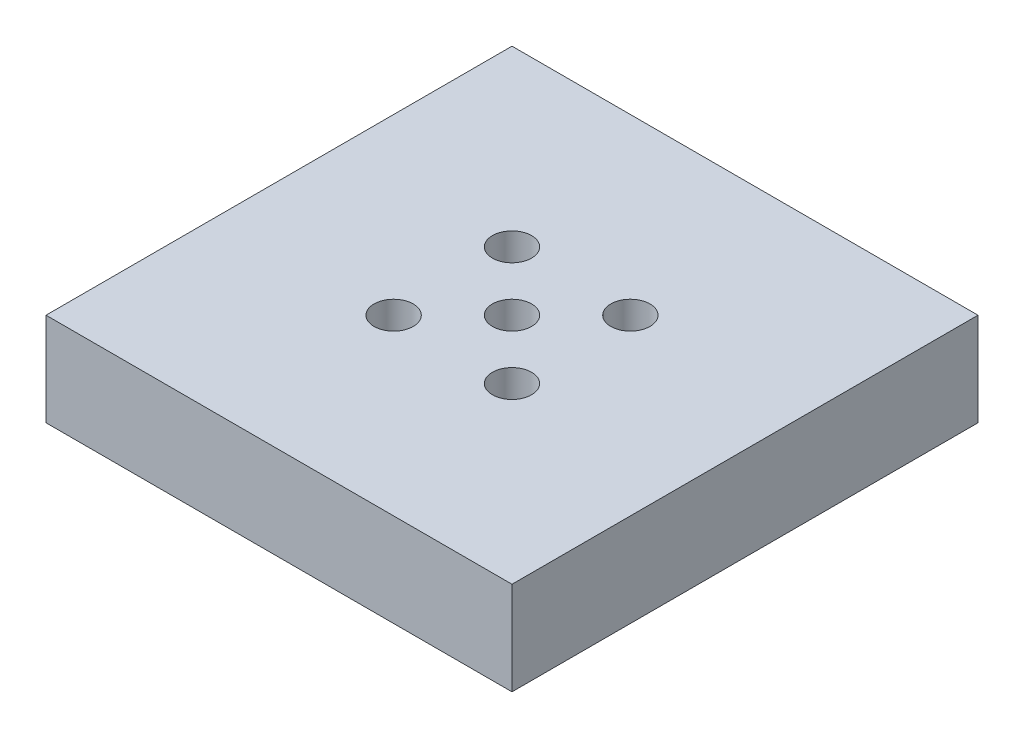
ISO-10303-21;
HEADER;
FILE_DESCRIPTION(('STEP AP214'),'2;1');
FILE_NAME('part.step','',(''),(''),'','','');
FILE_SCHEMA(('AUTOMOTIVE_DESIGN { 1 0 10303 214 1 1 1 1 }'));
ENDSEC;
DATA;
#1=APPLICATION_CONTEXT('core data for automotive mechanical design processes');
#2=APPLICATION_PROTOCOL_DEFINITION('international standard','automotive_design',2000,#1);
#3=PRODUCT_CONTEXT('',#1,'mechanical');
#4=PRODUCT('Part','Part','',(#3));
#5=PRODUCT_RELATED_PRODUCT_CATEGORY('part','',(#4));
#6=PRODUCT_DEFINITION_FORMATION('','',#4);
#7=PRODUCT_DEFINITION_CONTEXT('part definition',#1,'design');
#8=PRODUCT_DEFINITION('design','',#6,#7);
#9=PRODUCT_DEFINITION_SHAPE('','',#8);
#10=(LENGTH_UNIT() NAMED_UNIT(*) SI_UNIT(.MILLI.,.METRE.));
#11=(NAMED_UNIT(*) PLANE_ANGLE_UNIT() SI_UNIT($,.RADIAN.));
#12=(NAMED_UNIT(*) SI_UNIT($,.STERADIAN.) SOLID_ANGLE_UNIT());
#13=UNCERTAINTY_MEASURE_WITH_UNIT(LENGTH_MEASURE(1.E-05),#10,'distance_accuracy_value','');
#14=(GEOMETRIC_REPRESENTATION_CONTEXT(3) GLOBAL_UNCERTAINTY_ASSIGNED_CONTEXT((#13)) GLOBAL_UNIT_ASSIGNED_CONTEXT((#10,
#11,#12)) REPRESENTATION_CONTEXT('',''));
#15=CARTESIAN_POINT('',(0.,0.,0.));
#16=DIRECTION('',(0.,0.,1.));
#17=DIRECTION('',(1.,0.,0.));
#18=AXIS2_PLACEMENT_3D('',#15,#16,#17);
#19=CARTESIAN_POINT('',(25.,10.,-25.));
#20=DIRECTION('',(-1.,0.,0.));
#21=DIRECTION('',(0.,0.,1.));
#22=AXIS2_PLACEMENT_3D('',#19,#20,#21);
#23=PLANE('',#22);
#24=DIRECTION('',(0.,0.,-1.));
#25=VECTOR('',#24,1.);
#26=CARTESIAN_POINT('',(25.,0.,-25.));
#27=LINE('',#26,#25);
#28=CARTESIAN_POINT('',(25.,0.,25.));
#29=VERTEX_POINT('',#28);
#30=CARTESIAN_POINT('',(25.,0.,-25.));
#31=VERTEX_POINT('',#30);
#32=EDGE_CURVE('E206',#29,#31,#27,.T.);
#33=ORIENTED_EDGE('',*,*,#32,.T.);
#34=DIRECTION('',(0.,-1.,0.));
#35=VECTOR('',#34,1.);
#36=CARTESIAN_POINT('',(25.,10.,-25.));
#37=LINE('',#36,#35);
#38=CARTESIAN_POINT('',(25.,10.,-25.));
#39=VERTEX_POINT('',#38);
#40=EDGE_CURVE('E11',#39,#31,#37,.T.);
#41=ORIENTED_EDGE('',*,*,#40,.F.);
#42=DIRECTION('',(0.,0.,-1.));
#43=VECTOR('',#42,1.);
#44=CARTESIAN_POINT('',(25.,10.,-25.));
#45=LINE('',#44,#43);
#46=CARTESIAN_POINT('',(25.,10.,25.));
#47=VERTEX_POINT('',#46);
#48=EDGE_CURVE('E207',#47,#39,#45,.T.);
#49=ORIENTED_EDGE('',*,*,#48,.F.);
#50=DIRECTION('',(0.,-1.,0.));
#51=VECTOR('',#50,1.);
#52=CARTESIAN_POINT('',(25.,10.,25.));
#53=LINE('',#52,#51);
#54=EDGE_CURVE('E217',#47,#29,#53,.T.);
#55=ORIENTED_EDGE('',*,*,#54,.T.);
#56=EDGE_LOOP('',(#33,#41,#49,#55));
#57=FACE_BOUND('',#56,.T.);
#58=ADVANCED_FACE('F45',(#57),#23,.F.);
#59=CARTESIAN_POINT('',(-25.,10.,-25.));
#60=DIRECTION('',(0.,0.,1.));
#61=DIRECTION('',(1.,0.,0.));
#62=AXIS2_PLACEMENT_3D('',#59,#60,#61);
#63=PLANE('',#62);
#64=DIRECTION('',(-1.,0.,0.));
#65=VECTOR('',#64,1.);
#66=CARTESIAN_POINT('',(-25.,0.,-25.));
#67=LINE('',#66,#65);
#68=CARTESIAN_POINT('',(-25.,0.,-25.));
#69=VERTEX_POINT('',#68);
#70=EDGE_CURVE('E221',#31,#69,#67,.T.);
#71=ORIENTED_EDGE('',*,*,#70,.T.);
#72=DIRECTION('',(0.,-1.,0.));
#73=VECTOR('',#72,1.);
#74=CARTESIAN_POINT('',(-25.,10.,-25.));
#75=LINE('',#74,#73);
#76=CARTESIAN_POINT('',(-25.,10.,-25.));
#77=VERTEX_POINT('',#76);
#78=EDGE_CURVE('E53',#77,#69,#75,.T.);
#79=ORIENTED_EDGE('',*,*,#78,.F.);
#80=DIRECTION('',(-1.,0.,0.));
#81=VECTOR('',#80,1.);
#82=CARTESIAN_POINT('',(-25.,10.,-25.));
#83=LINE('',#82,#81);
#84=EDGE_CURVE('E97',#39,#77,#83,.T.);
#85=ORIENTED_EDGE('',*,*,#84,.F.);
#86=ORIENTED_EDGE('',*,*,#40,.T.);
#87=EDGE_LOOP('',(#71,#79,#85,#86));
#88=FACE_BOUND('',#87,.T.);
#89=ADVANCED_FACE('F256',(#88),#63,.F.);
#90=CARTESIAN_POINT('',(-25.,10.,-25.));
#91=DIRECTION('',(1.,0.,0.));
#92=DIRECTION('',(0.,0.,-1.));
#93=AXIS2_PLACEMENT_3D('',#90,#91,#92);
#94=PLANE('',#93);
#95=DIRECTION('',(0.,0.,1.));
#96=VECTOR('',#95,1.);
#97=CARTESIAN_POINT('',(-25.,0.,-25.));
#98=LINE('',#97,#96);
#99=CARTESIAN_POINT('',(-25.,0.,25.));
#100=VERTEX_POINT('',#99);
#101=EDGE_CURVE('E224',#69,#100,#98,.T.);
#102=ORIENTED_EDGE('',*,*,#101,.T.);
#103=DIRECTION('',(0.,-1.,0.));
#104=VECTOR('',#103,1.);
#105=CARTESIAN_POINT('',(-25.,10.,25.));
#106=LINE('',#105,#104);
#107=CARTESIAN_POINT('',(-25.,10.,25.));
#108=VERTEX_POINT('',#107);
#109=EDGE_CURVE('E231',#108,#100,#106,.T.);
#110=ORIENTED_EDGE('',*,*,#109,.F.);
#111=DIRECTION('',(0.,0.,1.));
#112=VECTOR('',#111,1.);
#113=CARTESIAN_POINT('',(-25.,10.,-25.));
#114=LINE('',#113,#112);
#115=EDGE_CURVE('E212',#77,#108,#114,.T.);
#116=ORIENTED_EDGE('',*,*,#115,.F.);
#117=ORIENTED_EDGE('',*,*,#78,.T.);
#118=EDGE_LOOP('',(#102,#110,#116,#117));
#119=FACE_BOUND('',#118,.T.);
#120=ADVANCED_FACE('F238',(#119),#94,.F.);
#121=CARTESIAN_POINT('',(-25.,10.,25.));
#122=DIRECTION('',(0.,0.,-1.));
#123=DIRECTION('',(-1.,0.,0.));
#124=AXIS2_PLACEMENT_3D('',#121,#122,#123);
#125=PLANE('',#124);
#126=DIRECTION('',(1.,0.,0.));
#127=VECTOR('',#126,1.);
#128=CARTESIAN_POINT('',(-25.,0.,25.));
#129=LINE('',#128,#127);
#130=EDGE_CURVE('E90',#100,#29,#129,.T.);
#131=ORIENTED_EDGE('',*,*,#130,.T.);
#132=ORIENTED_EDGE('',*,*,#54,.F.);
#133=DIRECTION('',(1.,0.,0.));
#134=VECTOR('',#133,1.);
#135=CARTESIAN_POINT('',(-25.,10.,25.));
#136=LINE('',#135,#134);
#137=EDGE_CURVE('E69',#108,#47,#136,.T.);
#138=ORIENTED_EDGE('',*,*,#137,.F.);
#139=ORIENTED_EDGE('',*,*,#109,.T.);
#140=EDGE_LOOP('',(#131,#132,#138,#139));
#141=FACE_BOUND('',#140,.T.);
#142=ADVANCED_FACE('F246',(#141),#125,.F.);
#143=CARTESIAN_POINT('',(0.,10.,0.));
#144=DIRECTION('',(0.,1.,0.));
#145=DIRECTION('',(0.,0.,1.));
#146=AXIS2_PLACEMENT_3D('',#143,#144,#145);
#147=PLANE('',#146);
#148=CARTESIAN_POINT('',(6.35,10.,6.35));
#149=DIRECTION('',(0.,1.,0.));
#150=DIRECTION('',(0.,0.,1.));
#151=AXIS2_PLACEMENT_3D('',#148,#149,#150);
#152=CIRCLE('',#151,2.1);
#153=CARTESIAN_POINT('',(6.35,10.,8.45));
#154=VERTEX_POINT('',#153);
#155=EDGE_CURVE('E190',#154,#154,#152,.T.);
#156=ORIENTED_EDGE('',*,*,#155,.F.);
#157=EDGE_LOOP('',(#156));
#158=FACE_BOUND('',#157,.T.);
#159=CARTESIAN_POINT('',(-6.35,10.,6.35));
#160=DIRECTION('',(0.,1.,0.));
#161=DIRECTION('',(0.,0.,1.));
#162=AXIS2_PLACEMENT_3D('',#159,#160,#161);
#163=CIRCLE('',#162,2.1);
#164=CARTESIAN_POINT('',(-6.35,10.,8.45));
#165=VERTEX_POINT('',#164);
#166=EDGE_CURVE('E182',#165,#165,#163,.T.);
#167=ORIENTED_EDGE('',*,*,#166,.F.);
#168=EDGE_LOOP('',(#167));
#169=FACE_BOUND('',#168,.T.);
#170=CARTESIAN_POINT('',(-6.35,10.,-6.35));
#171=DIRECTION('',(0.,1.,0.));
#172=DIRECTION('',(0.,0.,1.));
#173=AXIS2_PLACEMENT_3D('',#170,#171,#172);
#174=CIRCLE('',#173,2.1);
#175=CARTESIAN_POINT('',(-6.35,10.,-4.25));
#176=VERTEX_POINT('',#175);
#177=EDGE_CURVE('E172',#176,#176,#174,.T.);
#178=ORIENTED_EDGE('',*,*,#177,.F.);
#179=EDGE_LOOP('',(#178));
#180=FACE_BOUND('',#179,.T.);
#181=CARTESIAN_POINT('',(6.35,10.,-6.35));
#182=DIRECTION('',(0.,1.,0.));
#183=DIRECTION('',(0.,0.,1.));
#184=AXIS2_PLACEMENT_3D('',#181,#182,#183);
#185=CIRCLE('',#184,2.1);
#186=CARTESIAN_POINT('',(6.35,10.,-4.25));
#187=VERTEX_POINT('',#186);
#188=EDGE_CURVE('E167',#187,#187,#185,.T.);
#189=ORIENTED_EDGE('',*,*,#188,.F.);
#190=EDGE_LOOP('',(#189));
#191=FACE_BOUND('',#190,.T.);
#192=CARTESIAN_POINT('',(0.,10.,0.));
#193=DIRECTION('',(0.,1.,0.));
#194=DIRECTION('',(0.,0.,1.));
#195=AXIS2_PLACEMENT_3D('',#192,#193,#194);
#196=CIRCLE('',#195,2.1);
#197=CARTESIAN_POINT('',(0.,10.,2.1));
#198=VERTEX_POINT('',#197);
#199=EDGE_CURVE('E171',#198,#198,#196,.T.);
#200=ORIENTED_EDGE('',*,*,#199,.F.);
#201=EDGE_LOOP('',(#200));
#202=FACE_BOUND('',#201,.T.);
#203=ORIENTED_EDGE('',*,*,#48,.T.);
#204=ORIENTED_EDGE('',*,*,#84,.T.);
#205=ORIENTED_EDGE('',*,*,#115,.T.);
#206=ORIENTED_EDGE('',*,*,#137,.T.);
#207=EDGE_LOOP('',(#203,#204,#205,#206));
#208=FACE_BOUND('',#207,.T.);
#209=ADVANCED_FACE('F248',(#158,#169,#180,#191,#202,#208),#147,.T.);
#210=CARTESIAN_POINT('',(0.,0.,0.));
#211=DIRECTION('',(0.,1.,0.));
#212=DIRECTION('',(0.,0.,1.));
#213=AXIS2_PLACEMENT_3D('',#210,#211,#212);
#214=PLANE('',#213);
#215=DIRECTION('',(0.,0.,-1.));
#216=VECTOR('',#215,1.);
#217=CARTESIAN_POINT('',(-10.,0.,-10.));
#218=LINE('',#217,#216);
#219=CARTESIAN_POINT('',(-10.,0.,10.));
#220=VERTEX_POINT('',#219);
#221=CARTESIAN_POINT('',(-10.,0.,-10.));
#222=VERTEX_POINT('',#221);
#223=EDGE_CURVE('E147',#220,#222,#218,.T.);
#224=ORIENTED_EDGE('',*,*,#223,.F.);
#225=DIRECTION('',(-1.,0.,0.));
#226=VECTOR('',#225,1.);
#227=CARTESIAN_POINT('',(-10.,0.,10.));
#228=LINE('',#227,#226);
#229=CARTESIAN_POINT('',(10.,0.,10.));
#230=VERTEX_POINT('',#229);
#231=EDGE_CURVE('E137',#230,#220,#228,.T.);
#232=ORIENTED_EDGE('',*,*,#231,.F.);
#233=DIRECTION('',(0.,0.,1.));
#234=VECTOR('',#233,1.);
#235=CARTESIAN_POINT('',(10.,0.,-10.));
#236=LINE('',#235,#234);
#237=CARTESIAN_POINT('',(10.,0.,-10.));
#238=VERTEX_POINT('',#237);
#239=EDGE_CURVE('E151',#238,#230,#236,.T.);
#240=ORIENTED_EDGE('',*,*,#239,.F.);
#241=DIRECTION('',(1.,0.,0.));
#242=VECTOR('',#241,1.);
#243=CARTESIAN_POINT('',(-10.,0.,-10.));
#244=LINE('',#243,#242);
#245=EDGE_CURVE('E60',#222,#238,#244,.T.);
#246=ORIENTED_EDGE('',*,*,#245,.F.);
#247=EDGE_LOOP('',(#224,#232,#240,#246));
#248=FACE_BOUND('',#247,.T.);
#249=ORIENTED_EDGE('',*,*,#32,.F.);
#250=ORIENTED_EDGE('',*,*,#130,.F.);
#251=ORIENTED_EDGE('',*,*,#101,.F.);
#252=ORIENTED_EDGE('',*,*,#70,.F.);
#253=EDGE_LOOP('',(#249,#250,#251,#252));
#254=FACE_BOUND('',#253,.T.);
#255=ADVANCED_FACE('F242',(#248,#254),#214,.F.);
#256=CARTESIAN_POINT('',(0.,5.43,0.));
#257=DIRECTION('',(0.,1.,0.));
#258=DIRECTION('',(0.,0.,1.));
#259=AXIS2_PLACEMENT_3D('',#256,#257,#258);
#260=CYLINDRICAL_SURFACE('',#259,2.1);
#261=CARTESIAN_POINT('',(0.,5.43,0.));
#262=DIRECTION('',(0.,1.,0.));
#263=DIRECTION('',(0.,0.,1.));
#264=AXIS2_PLACEMENT_3D('',#261,#262,#263);
#265=CIRCLE('',#264,2.1);
#266=CARTESIAN_POINT('',(0.,5.43,2.1));
#267=VERTEX_POINT('',#266);
#268=EDGE_CURVE('E177',#267,#267,#265,.T.);
#269=ORIENTED_EDGE('',*,*,#268,.F.);
#270=EDGE_LOOP('',(#269));
#271=FACE_BOUND('',#270,.T.);
#272=ORIENTED_EDGE('',*,*,#199,.T.);
#273=EDGE_LOOP('',(#272));
#274=FACE_BOUND('',#273,.T.);
#275=ADVANCED_FACE('F291',(#271,#274),#260,.F.);
#276=CARTESIAN_POINT('',(6.35,5.43,-6.35));
#277=DIRECTION('',(0.,1.,0.));
#278=DIRECTION('',(0.,0.,1.));
#279=AXIS2_PLACEMENT_3D('',#276,#277,#278);
#280=CYLINDRICAL_SURFACE('',#279,2.1);
#281=CARTESIAN_POINT('',(6.35,5.43,-6.35));
#282=DIRECTION('',(0.,1.,0.));
#283=DIRECTION('',(0.,0.,1.));
#284=AXIS2_PLACEMENT_3D('',#281,#282,#283);
#285=CIRCLE('',#284,2.1);
#286=CARTESIAN_POINT('',(6.35,5.43,-4.25));
#287=VERTEX_POINT('',#286);
#288=EDGE_CURVE('E173',#287,#287,#285,.T.);
#289=ORIENTED_EDGE('',*,*,#288,.F.);
#290=EDGE_LOOP('',(#289));
#291=FACE_BOUND('',#290,.T.);
#292=ORIENTED_EDGE('',*,*,#188,.T.);
#293=EDGE_LOOP('',(#292));
#294=FACE_BOUND('',#293,.T.);
#295=ADVANCED_FACE('F301',(#291,#294),#280,.F.);
#296=CARTESIAN_POINT('',(-6.35,5.43,-6.35));
#297=DIRECTION('',(0.,1.,0.));
#298=DIRECTION('',(0.,0.,1.));
#299=AXIS2_PLACEMENT_3D('',#296,#297,#298);
#300=CYLINDRICAL_SURFACE('',#299,2.1);
#301=CARTESIAN_POINT('',(-6.35,5.43,-6.35));
#302=DIRECTION('',(0.,1.,0.));
#303=DIRECTION('',(0.,0.,1.));
#304=AXIS2_PLACEMENT_3D('',#301,#302,#303);
#305=CIRCLE('',#304,2.1);
#306=CARTESIAN_POINT('',(-6.35,5.43,-4.25));
#307=VERTEX_POINT('',#306);
#308=EDGE_CURVE('E178',#307,#307,#305,.T.);
#309=ORIENTED_EDGE('',*,*,#308,.F.);
#310=EDGE_LOOP('',(#309));
#311=FACE_BOUND('',#310,.T.);
#312=ORIENTED_EDGE('',*,*,#177,.T.);
#313=EDGE_LOOP('',(#312));
#314=FACE_BOUND('',#313,.T.);
#315=ADVANCED_FACE('F311',(#311,#314),#300,.F.);
#316=CARTESIAN_POINT('',(-6.35,5.43,6.35));
#317=DIRECTION('',(0.,1.,0.));
#318=DIRECTION('',(0.,0.,1.));
#319=AXIS2_PLACEMENT_3D('',#316,#317,#318);
#320=CYLINDRICAL_SURFACE('',#319,2.1);
#321=CARTESIAN_POINT('',(-6.35,5.43,6.35));
#322=DIRECTION('',(0.,1.,0.));
#323=DIRECTION('',(0.,0.,1.));
#324=AXIS2_PLACEMENT_3D('',#321,#322,#323);
#325=CIRCLE('',#324,2.1);
#326=CARTESIAN_POINT('',(-6.35,5.43,8.45));
#327=VERTEX_POINT('',#326);
#328=EDGE_CURVE('E186',#327,#327,#325,.T.);
#329=ORIENTED_EDGE('',*,*,#328,.F.);
#330=EDGE_LOOP('',(#329));
#331=FACE_BOUND('',#330,.T.);
#332=ORIENTED_EDGE('',*,*,#166,.T.);
#333=EDGE_LOOP('',(#332));
#334=FACE_BOUND('',#333,.T.);
#335=ADVANCED_FACE('F321',(#331,#334),#320,.F.);
#336=CARTESIAN_POINT('',(6.35,5.43,6.35));
#337=DIRECTION('',(0.,1.,0.));
#338=DIRECTION('',(0.,0.,1.));
#339=AXIS2_PLACEMENT_3D('',#336,#337,#338);
#340=CYLINDRICAL_SURFACE('',#339,2.1);
#341=CARTESIAN_POINT('',(6.35,5.43,6.35));
#342=DIRECTION('',(0.,1.,0.));
#343=DIRECTION('',(0.,0.,1.));
#344=AXIS2_PLACEMENT_3D('',#341,#342,#343);
#345=CIRCLE('',#344,2.1);
#346=CARTESIAN_POINT('',(6.35,5.43,8.45));
#347=VERTEX_POINT('',#346);
#348=EDGE_CURVE('E166',#347,#347,#345,.T.);
#349=ORIENTED_EDGE('',*,*,#348,.F.);
#350=EDGE_LOOP('',(#349));
#351=FACE_BOUND('',#350,.T.);
#352=ORIENTED_EDGE('',*,*,#155,.T.);
#353=EDGE_LOOP('',(#352));
#354=FACE_BOUND('',#353,.T.);
#355=ADVANCED_FACE('F331',(#351,#354),#340,.F.);
#356=CARTESIAN_POINT('',(-6.35,5.43,6.35));
#357=DIRECTION('',(0.,1.,0.));
#358=DIRECTION('',(0.,0.,1.));
#359=AXIS2_PLACEMENT_3D('',#356,#357,#358);
#360=PLANE('',#359);
#361=ORIENTED_EDGE('',*,*,#268,.T.);
#362=EDGE_LOOP('',(#361));
#363=FACE_BOUND('',#362,.T.);
#364=ORIENTED_EDGE('',*,*,#288,.T.);
#365=EDGE_LOOP('',(#364));
#366=FACE_BOUND('',#365,.T.);
#367=ORIENTED_EDGE('',*,*,#308,.T.);
#368=EDGE_LOOP('',(#367));
#369=FACE_BOUND('',#368,.T.);
#370=ORIENTED_EDGE('',*,*,#328,.T.);
#371=EDGE_LOOP('',(#370));
#372=FACE_BOUND('',#371,.T.);
#373=ORIENTED_EDGE('',*,*,#348,.T.);
#374=EDGE_LOOP('',(#373));
#375=FACE_BOUND('',#374,.T.);
#376=DIRECTION('',(0.,0.,1.));
#377=VECTOR('',#376,1.);
#378=CARTESIAN_POINT('',(10.,5.43,-10.));
#379=LINE('',#378,#377);
#380=CARTESIAN_POINT('',(10.,5.43,-10.));
#381=VERTEX_POINT('',#380);
#382=CARTESIAN_POINT('',(10.,5.43,10.));
#383=VERTEX_POINT('',#382);
#384=EDGE_CURVE('E142',#381,#383,#379,.T.);
#385=ORIENTED_EDGE('',*,*,#384,.T.);
#386=DIRECTION('',(-1.,0.,0.));
#387=VECTOR('',#386,1.);
#388=CARTESIAN_POINT('',(-10.,5.43,10.));
#389=LINE('',#388,#387);
#390=CARTESIAN_POINT('',(-10.,5.43,10.));
#391=VERTEX_POINT('',#390);
#392=EDGE_CURVE('E134',#383,#391,#389,.T.);
#393=ORIENTED_EDGE('',*,*,#392,.T.);
#394=DIRECTION('',(0.,0.,-1.));
#395=VECTOR('',#394,1.);
#396=CARTESIAN_POINT('',(-10.,5.43,-10.));
#397=LINE('',#396,#395);
#398=CARTESIAN_POINT('',(-10.,5.43,-10.));
#399=VERTEX_POINT('',#398);
#400=EDGE_CURVE('E120',#391,#399,#397,.T.);
#401=ORIENTED_EDGE('',*,*,#400,.T.);
#402=DIRECTION('',(1.,0.,0.));
#403=VECTOR('',#402,1.);
#404=CARTESIAN_POINT('',(-10.,5.43,-10.));
#405=LINE('',#404,#403);
#406=EDGE_CURVE('E157',#399,#381,#405,.T.);
#407=ORIENTED_EDGE('',*,*,#406,.T.);
#408=EDGE_LOOP('',(#385,#393,#401,#407));
#409=FACE_BOUND('',#408,.T.);
#410=ADVANCED_FACE('F141',(#363,#366,#369,#372,#375,#409),#360,.F.);
#411=CARTESIAN_POINT('',(-10.,33.7142712474619,10.));
#412=DIRECTION('',(0.,0.,1.));
#413=DIRECTION('',(1.,0.,0.));
#414=AXIS2_PLACEMENT_3D('',#411,#412,#413);
#415=PLANE('',#414);
#416=DIRECTION('',(0.,-1.,0.));
#417=VECTOR('',#416,1.);
#418=CARTESIAN_POINT('',(10.,33.7142712474619,10.));
#419=LINE('',#418,#417);
#420=EDGE_CURVE('E155',#383,#230,#419,.T.);
#421=ORIENTED_EDGE('',*,*,#420,.T.);
#422=ORIENTED_EDGE('',*,*,#231,.T.);
#423=DIRECTION('',(0.,-1.,0.));
#424=VECTOR('',#423,1.);
#425=CARTESIAN_POINT('',(-10.,33.7142712474619,10.));
#426=LINE('',#425,#424);
#427=EDGE_CURVE('E124',#391,#220,#426,.T.);
#428=ORIENTED_EDGE('',*,*,#427,.F.);
#429=ORIENTED_EDGE('',*,*,#392,.F.);
#430=EDGE_LOOP('',(#421,#422,#428,#429));
#431=FACE_BOUND('',#430,.T.);
#432=ADVANCED_FACE('F133',(#431),#415,.F.);
#433=CARTESIAN_POINT('',(-10.,33.7142712474619,-10.));
#434=DIRECTION('',(-1.,0.,0.));
#435=DIRECTION('',(0.,0.,1.));
#436=AXIS2_PLACEMENT_3D('',#433,#434,#435);
#437=PLANE('',#436);
#438=ORIENTED_EDGE('',*,*,#427,.T.);
#439=ORIENTED_EDGE('',*,*,#223,.T.);
#440=DIRECTION('',(0.,-1.,0.));
#441=VECTOR('',#440,1.);
#442=CARTESIAN_POINT('',(-10.,33.7142712474619,-10.));
#443=LINE('',#442,#441);
#444=EDGE_CURVE('E126',#399,#222,#443,.T.);
#445=ORIENTED_EDGE('',*,*,#444,.F.);
#446=ORIENTED_EDGE('',*,*,#400,.F.);
#447=EDGE_LOOP('',(#438,#439,#445,#446));
#448=FACE_BOUND('',#447,.T.);
#449=ADVANCED_FACE('F122',(#448),#437,.F.);
#450=CARTESIAN_POINT('',(-10.,33.7142712474619,-10.));
#451=DIRECTION('',(0.,0.,-1.));
#452=DIRECTION('',(-1.,0.,0.));
#453=AXIS2_PLACEMENT_3D('',#450,#451,#452);
#454=PLANE('',#453);
#455=ORIENTED_EDGE('',*,*,#444,.T.);
#456=ORIENTED_EDGE('',*,*,#245,.T.);
#457=DIRECTION('',(0.,-1.,0.));
#458=VECTOR('',#457,1.);
#459=CARTESIAN_POINT('',(10.,33.7142712474619,-10.));
#460=LINE('',#459,#458);
#461=EDGE_CURVE('E156',#381,#238,#460,.T.);
#462=ORIENTED_EDGE('',*,*,#461,.F.);
#463=ORIENTED_EDGE('',*,*,#406,.F.);
#464=EDGE_LOOP('',(#455,#456,#462,#463));
#465=FACE_BOUND('',#464,.T.);
#466=ADVANCED_FACE('F365',(#465),#454,.F.);
#467=CARTESIAN_POINT('',(10.,33.7142712474619,-10.));
#468=DIRECTION('',(1.,0.,0.));
#469=DIRECTION('',(0.,0.,-1.));
#470=AXIS2_PLACEMENT_3D('',#467,#468,#469);
#471=PLANE('',#470);
#472=ORIENTED_EDGE('',*,*,#461,.T.);
#473=ORIENTED_EDGE('',*,*,#239,.T.);
#474=ORIENTED_EDGE('',*,*,#420,.F.);
#475=ORIENTED_EDGE('',*,*,#384,.F.);
#476=EDGE_LOOP('',(#472,#473,#474,#475));
#477=FACE_BOUND('',#476,.T.);
#478=ADVANCED_FACE('F374',(#477),#471,.F.);
#479=CLOSED_SHELL('',(#58,#89,#120,#142,#209,#255,#275,#295,#315,#335,#355,#410,#432,#449,#466,#478));
#480=MANIFOLD_SOLID_BREP('B2',#479);
#481=ADVANCED_BREP_SHAPE_REPRESENTATION('',(#18,#480),#14);
#482=SHAPE_DEFINITION_REPRESENTATION(#9,#481);
ENDSEC;
END-ISO-10303-21;
